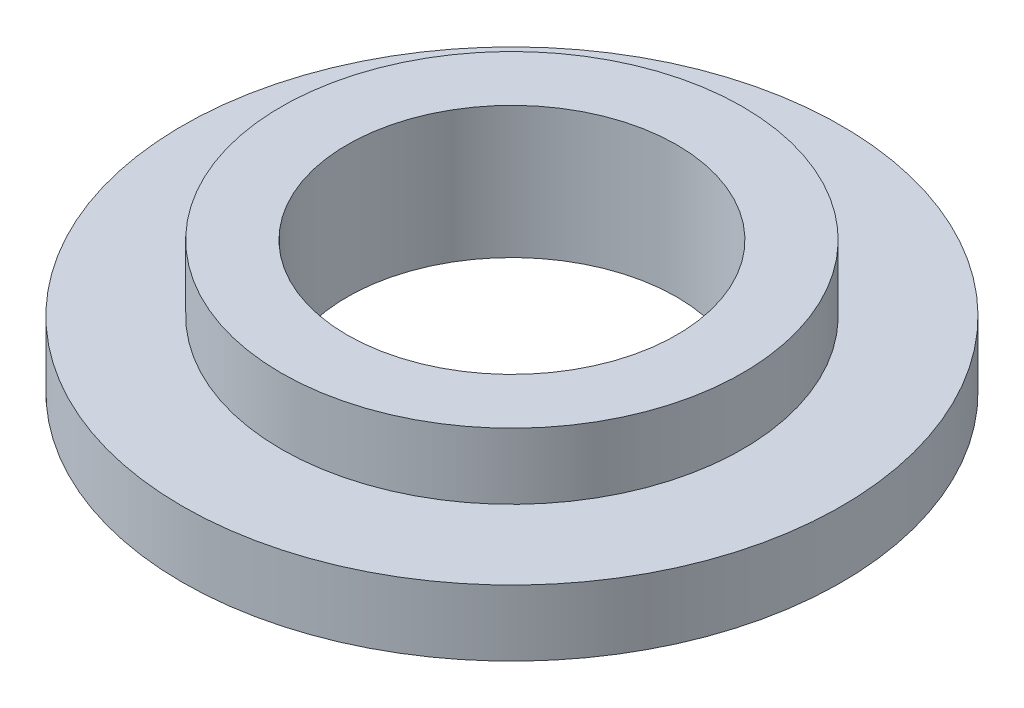
ISO-10303-21;
HEADER;
FILE_DESCRIPTION(('STEP AP214'),'2;1');
FILE_NAME('part.step','',(''),(''),'','','');
FILE_SCHEMA(('AUTOMOTIVE_DESIGN { 1 0 10303 214 1 1 1 1 }'));
ENDSEC;
DATA;
#1=APPLICATION_CONTEXT('core data for automotive mechanical design processes');
#2=APPLICATION_PROTOCOL_DEFINITION('international standard','automotive_design',2000,#1);
#3=PRODUCT_CONTEXT('',#1,'mechanical');
#4=PRODUCT('Part','Part','',(#3));
#5=PRODUCT_RELATED_PRODUCT_CATEGORY('part','',(#4));
#6=PRODUCT_DEFINITION_FORMATION('','',#4);
#7=PRODUCT_DEFINITION_CONTEXT('part definition',#1,'design');
#8=PRODUCT_DEFINITION('design','',#6,#7);
#9=PRODUCT_DEFINITION_SHAPE('','',#8);
#10=(LENGTH_UNIT() NAMED_UNIT(*) SI_UNIT(.MILLI.,.METRE.));
#11=(NAMED_UNIT(*) PLANE_ANGLE_UNIT() SI_UNIT($,.RADIAN.));
#12=(NAMED_UNIT(*) SI_UNIT($,.STERADIAN.) SOLID_ANGLE_UNIT());
#13=UNCERTAINTY_MEASURE_WITH_UNIT(LENGTH_MEASURE(1.E-05),#10,'distance_accuracy_value','');
#14=(GEOMETRIC_REPRESENTATION_CONTEXT(3) GLOBAL_UNCERTAINTY_ASSIGNED_CONTEXT((#13)) GLOBAL_UNIT_ASSIGNED_CONTEXT((#10,
#11,#12)) REPRESENTATION_CONTEXT('',''));
#15=CARTESIAN_POINT('',(0.,0.,0.));
#16=DIRECTION('',(0.,0.,1.));
#17=DIRECTION('',(1.,0.,0.));
#18=AXIS2_PLACEMENT_3D('',#15,#16,#17);
#19=CARTESIAN_POINT('',(0.,30.7840539451222,0.));
#20=DIRECTION('',(0.,1.,0.));
#21=DIRECTION('',(0.,0.,1.));
#22=AXIS2_PLACEMENT_3D('',#19,#20,#21);
#23=CYLINDRICAL_SURFACE('',#22,25.);
#24=CARTESIAN_POINT('',(0.,0.,0.));
#25=DIRECTION('',(0.,1.,0.));
#26=DIRECTION('',(0.,0.,1.));
#27=AXIS2_PLACEMENT_3D('',#24,#25,#26);
#28=CIRCLE('',#27,25.);
#29=CARTESIAN_POINT('',(0.,0.,25.));
#30=VERTEX_POINT('',#29);
#31=EDGE_CURVE('E10',#30,#30,#28,.T.);
#32=ORIENTED_EDGE('',*,*,#31,.F.);
#33=EDGE_LOOP('',(#32));
#34=FACE_BOUND('',#33,.T.);
#35=CARTESIAN_POINT('',(0.,20.,0.));
#36=DIRECTION('',(0.,1.,0.));
#37=DIRECTION('',(0.,0.,1.));
#38=AXIS2_PLACEMENT_3D('',#35,#36,#37);
#39=CIRCLE('',#38,25.);
#40=CARTESIAN_POINT('',(0.,20.,25.));
#41=VERTEX_POINT('',#40);
#42=EDGE_CURVE('E54',#41,#41,#39,.T.);
#43=ORIENTED_EDGE('',*,*,#42,.T.);
#44=EDGE_LOOP('',(#43));
#45=FACE_BOUND('',#44,.T.);
#46=ADVANCED_FACE('F32',(#34,#45),#23,.F.);
#47=CARTESIAN_POINT('',(0.,0.,-25.));
#48=DIRECTION('',(0.,1.,0.));
#49=DIRECTION('',(0.,0.,1.));
#50=AXIS2_PLACEMENT_3D('',#47,#48,#49);
#51=PLANE('',#50);
#52=CARTESIAN_POINT('',(0.,0.,0.));
#53=DIRECTION('',(0.,1.,0.));
#54=DIRECTION('',(0.,0.,1.));
#55=AXIS2_PLACEMENT_3D('',#52,#53,#54);
#56=CIRCLE('',#55,50.);
#57=CARTESIAN_POINT('',(0.,0.,50.));
#58=VERTEX_POINT('',#57);
#59=EDGE_CURVE('E38',#58,#58,#56,.T.);
#60=ORIENTED_EDGE('',*,*,#59,.F.);
#61=EDGE_LOOP('',(#60));
#62=FACE_BOUND('',#61,.T.);
#63=ORIENTED_EDGE('',*,*,#31,.T.);
#64=EDGE_LOOP('',(#63));
#65=FACE_BOUND('',#64,.T.);
#66=ADVANCED_FACE('F79',(#62,#65),#51,.F.);
#67=CARTESIAN_POINT('',(0.,30.7840539451222,0.));
#68=DIRECTION('',(0.,1.,0.));
#69=DIRECTION('',(0.,0.,1.));
#70=AXIS2_PLACEMENT_3D('',#67,#68,#69);
#71=CYLINDRICAL_SURFACE('',#70,50.);
#72=CARTESIAN_POINT('',(0.,10.,0.));
#73=DIRECTION('',(0.,1.,0.));
#74=DIRECTION('',(0.,0.,1.));
#75=AXIS2_PLACEMENT_3D('',#72,#73,#74);
#76=CIRCLE('',#75,50.);
#77=CARTESIAN_POINT('',(0.,10.,50.));
#78=VERTEX_POINT('',#77);
#79=EDGE_CURVE('E42',#78,#78,#76,.T.);
#80=ORIENTED_EDGE('',*,*,#79,.F.);
#81=EDGE_LOOP('',(#80));
#82=FACE_BOUND('',#81,.T.);
#83=ORIENTED_EDGE('',*,*,#59,.T.);
#84=EDGE_LOOP('',(#83));
#85=FACE_BOUND('',#84,.T.);
#86=ADVANCED_FACE('F74',(#82,#85),#71,.T.);
#87=CARTESIAN_POINT('',(0.,10.,-50.));
#88=DIRECTION('',(0.,-1.,0.));
#89=DIRECTION('',(0.,0.,-1.));
#90=AXIS2_PLACEMENT_3D('',#87,#88,#89);
#91=PLANE('',#90);
#92=CARTESIAN_POINT('',(0.,10.,0.));
#93=DIRECTION('',(0.,1.,0.));
#94=DIRECTION('',(0.,0.,1.));
#95=AXIS2_PLACEMENT_3D('',#92,#93,#94);
#96=CIRCLE('',#95,35.);
#97=CARTESIAN_POINT('',(0.,10.,35.));
#98=VERTEX_POINT('',#97);
#99=EDGE_CURVE('E46',#98,#98,#96,.T.);
#100=ORIENTED_EDGE('',*,*,#99,.F.);
#101=EDGE_LOOP('',(#100));
#102=FACE_BOUND('',#101,.T.);
#103=ORIENTED_EDGE('',*,*,#79,.T.);
#104=EDGE_LOOP('',(#103));
#105=FACE_BOUND('',#104,.T.);
#106=ADVANCED_FACE('F68',(#102,#105),#91,.F.);
#107=CARTESIAN_POINT('',(0.,30.7840539451222,0.));
#108=DIRECTION('',(0.,1.,0.));
#109=DIRECTION('',(0.,0.,1.));
#110=AXIS2_PLACEMENT_3D('',#107,#108,#109);
#111=CYLINDRICAL_SURFACE('',#110,35.);
#112=CARTESIAN_POINT('',(0.,20.,0.));
#113=DIRECTION('',(0.,1.,0.));
#114=DIRECTION('',(0.,0.,1.));
#115=AXIS2_PLACEMENT_3D('',#112,#113,#114);
#116=CIRCLE('',#115,35.);
#117=CARTESIAN_POINT('',(0.,20.,35.));
#118=VERTEX_POINT('',#117);
#119=EDGE_CURVE('E51',#118,#118,#116,.T.);
#120=ORIENTED_EDGE('',*,*,#119,.F.);
#121=EDGE_LOOP('',(#120));
#122=FACE_BOUND('',#121,.T.);
#123=ORIENTED_EDGE('',*,*,#99,.T.);
#124=EDGE_LOOP('',(#123));
#125=FACE_BOUND('',#124,.T.);
#126=ADVANCED_FACE('F62',(#122,#125),#111,.T.);
#127=CARTESIAN_POINT('',(0.,20.,-35.));
#128=DIRECTION('',(0.,-1.,0.));
#129=DIRECTION('',(0.,0.,-1.));
#130=AXIS2_PLACEMENT_3D('',#127,#128,#129);
#131=PLANE('',#130);
#132=ORIENTED_EDGE('',*,*,#42,.F.);
#133=EDGE_LOOP('',(#132));
#134=FACE_BOUND('',#133,.T.);
#135=ORIENTED_EDGE('',*,*,#119,.T.);
#136=EDGE_LOOP('',(#135));
#137=FACE_BOUND('',#136,.T.);
#138=ADVANCED_FACE('F59',(#134,#137),#131,.F.);
#139=CLOSED_SHELL('',(#46,#66,#86,#106,#126,#138));
#140=MANIFOLD_SOLID_BREP('B2',#139);
#141=ADVANCED_BREP_SHAPE_REPRESENTATION('',(#18,#140),#14);
#142=SHAPE_DEFINITION_REPRESENTATION(#9,#141);
ENDSEC;
END-ISO-10303-21;
